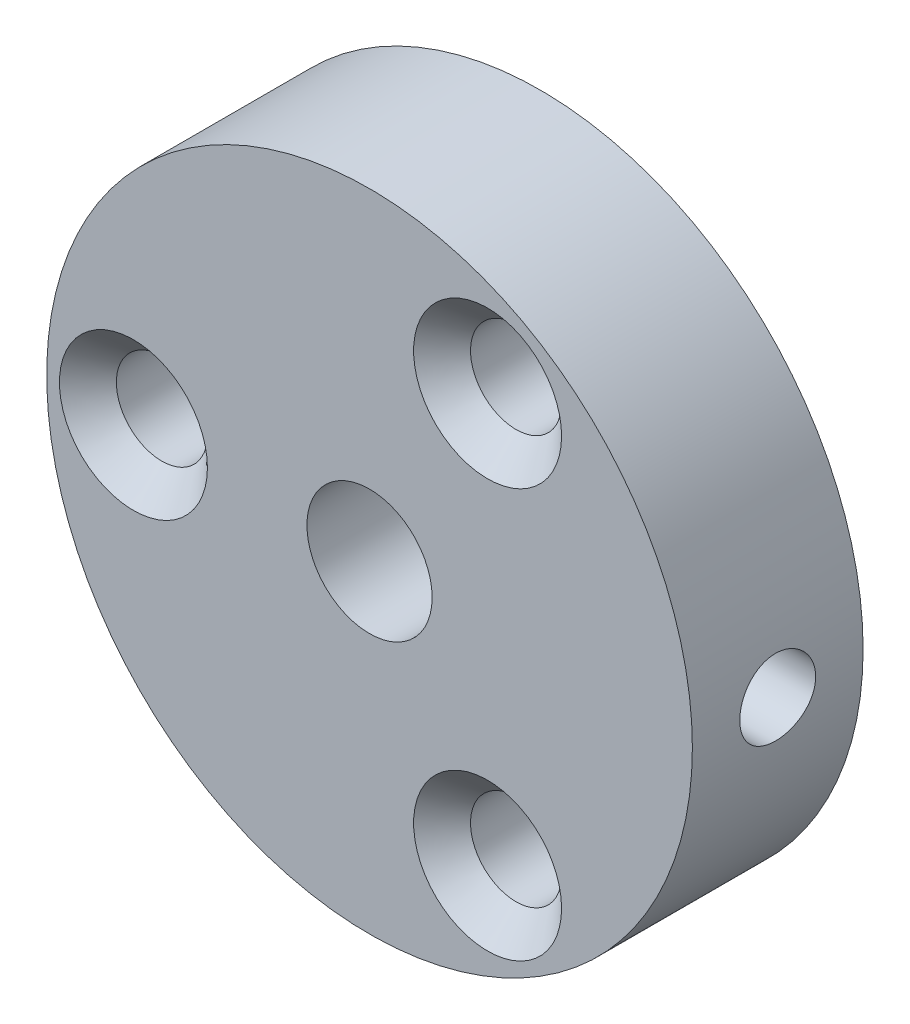
ISO-10303-21;
HEADER;
FILE_DESCRIPTION(('STEP AP214'),'2;1');
FILE_NAME('part.step','',(''),(''),'','','');
FILE_SCHEMA(('AUTOMOTIVE_DESIGN { 1 0 10303 214 1 1 1 1 }'));
ENDSEC;
DATA;
#1=APPLICATION_CONTEXT('core data for automotive mechanical design processes');
#2=APPLICATION_PROTOCOL_DEFINITION('international standard','automotive_design',2000,#1);
#3=PRODUCT_CONTEXT('',#1,'mechanical');
#4=PRODUCT('Part','Part','',(#3));
#5=PRODUCT_RELATED_PRODUCT_CATEGORY('part','',(#4));
#6=PRODUCT_DEFINITION_FORMATION('','',#4);
#7=PRODUCT_DEFINITION_CONTEXT('part definition',#1,'design');
#8=PRODUCT_DEFINITION('design','',#6,#7);
#9=PRODUCT_DEFINITION_SHAPE('','',#8);
#10=(LENGTH_UNIT() NAMED_UNIT(*) SI_UNIT(.MILLI.,.METRE.));
#11=(NAMED_UNIT(*) PLANE_ANGLE_UNIT() SI_UNIT($,.RADIAN.));
#12=(NAMED_UNIT(*) SI_UNIT($,.STERADIAN.) SOLID_ANGLE_UNIT());
#13=UNCERTAINTY_MEASURE_WITH_UNIT(LENGTH_MEASURE(1.E-05),#10,'distance_accuracy_value','');
#14=(GEOMETRIC_REPRESENTATION_CONTEXT(3) GLOBAL_UNCERTAINTY_ASSIGNED_CONTEXT((#13)) GLOBAL_UNIT_ASSIGNED_CONTEXT((#10,
#11,#12)) REPRESENTATION_CONTEXT('',''));
#15=CARTESIAN_POINT('',(0.,0.,0.));
#16=DIRECTION('',(0.,0.,1.));
#17=DIRECTION('',(1.,0.,0.));
#18=AXIS2_PLACEMENT_3D('',#15,#16,#17);
#19=CARTESIAN_POINT('',(0.,0.,2.25));
#20=DIRECTION('',(0.,0.,-1.));
#21=DIRECTION('',(-1.,0.,0.));
#22=AXIS2_PLACEMENT_3D('',#19,#20,#21);
#23=CYLINDRICAL_SURFACE('',#22,8.509);
#24=CARTESIAN_POINT('',(0.,0.,2.25));
#25=DIRECTION('',(0.,0.,1.));
#26=DIRECTION('',(1.,0.,0.));
#27=AXIS2_PLACEMENT_3D('',#24,#25,#26);
#28=CIRCLE('',#27,8.509);
#29=CARTESIAN_POINT('',(8.509,0.,2.25));
#30=VERTEX_POINT('',#29);
#31=EDGE_CURVE('E69',#30,#30,#28,.T.);
#32=ORIENTED_EDGE('',*,*,#31,.F.);
#33=EDGE_LOOP('',(#32));
#34=FACE_BOUND('',#33,.T.);
#35=CARTESIAN_POINT('',(0.,0.,-2.25));
#36=DIRECTION('',(0.,0.,1.));
#37=DIRECTION('',(1.,0.,0.));
#38=AXIS2_PLACEMENT_3D('',#35,#36,#37);
#39=CIRCLE('',#38,8.509);
#40=CARTESIAN_POINT('',(8.509,0.,-2.25));
#41=VERTEX_POINT('',#40);
#42=EDGE_CURVE('E70',#41,#41,#39,.T.);
#43=ORIENTED_EDGE('',*,*,#42,.T.);
#44=EDGE_LOOP('',(#43));
#45=FACE_BOUND('',#44,.T.);
#46=CARTESIAN_POINT('',(8.509,0.,1.));
#47=CARTESIAN_POINT('',(8.50899925825779,-0.0559634520903655,0.999997606608141));
#48=CARTESIAN_POINT('',(8.50844205250407,-0.111962530069736,0.995286305473793));
#49=CARTESIAN_POINT('',(8.50627283954904,-0.222404274914315,0.976565324354939));
#50=CARTESIAN_POINT('',(8.50465971141485,-0.276845223546583,0.962545762797024));
#51=CARTESIAN_POINT('',(8.5005604992414,-0.382555707204206,0.925625419940462));
#52=CARTESIAN_POINT('',(8.49807498355036,-0.433827281516426,0.902730419853047));
#53=CARTESIAN_POINT('',(8.49250791290803,-0.53179005335258,0.848721310130623));
#54=CARTESIAN_POINT('',(8.48942646544413,-0.578482074598571,0.817608682328109));
#55=CARTESIAN_POINT('',(8.48299508099071,-0.666198975034779,0.747884576200734));
#56=CARTESIAN_POINT('',(8.47964403116947,-0.707198237914693,0.709240970560579));
#57=CARTESIAN_POINT('',(8.47306017132751,-0.78214531751484,0.625620735354133));
#58=CARTESIAN_POINT('',(8.46982736715312,-0.816092785965369,0.580643793184871));
#59=CARTESIAN_POINT('',(8.4638349751161,-0.876066694216935,0.485468921310453));
#60=CARTESIAN_POINT('',(8.4610768172837,-0.902069374083602,0.435255921636007));
#61=CARTESIAN_POINT('',(8.45636045673469,-0.945263861567541,0.331138178339186));
#62=CARTESIAN_POINT('',(8.45440222711908,-0.962455965461184,0.277233558925333));
#63=CARTESIAN_POINT('',(8.45151792454899,-0.987463985059421,0.167527337329129));
#64=CARTESIAN_POINT('',(8.4505871147074,-0.995322943789538,0.11173567367804));
#65=CARTESIAN_POINT('',(8.44984849137229,-1.00157473295374,-0.000381874316133661));
#66=CARTESIAN_POINT('',(8.45004063777704,-0.999967901419329,-0.0567077395107053));
#67=CARTESIAN_POINT('',(8.45152188335809,-0.987369099886288,-0.167995889512193));
#68=CARTESIAN_POINT('',(8.45280545644521,-0.97642440820488,-0.222963610611169));
#69=CARTESIAN_POINT('',(8.45631630832853,-0.945534266900607,-0.330276708954445));
#70=CARTESIAN_POINT('',(8.45854360420851,-0.925588654337888,-0.382622038707648));
#71=CARTESIAN_POINT('',(8.46369724151993,-0.877211597513426,-0.483352135932232));
#72=CARTESIAN_POINT('',(8.46662528330115,-0.848759469796653,-0.531726879342225));
#73=CARTESIAN_POINT('',(8.47284914737392,-0.784191850599291,-0.623032829531791));
#74=CARTESIAN_POINT('',(8.47614498453892,-0.748076049150384,-0.66596381601854));
#75=CARTESIAN_POINT('',(8.48275767228527,-0.668943601082224,-0.745438120130147));
#76=CARTESIAN_POINT('',(8.48607452833307,-0.625886177186059,-0.781940847706062));
#77=CARTESIAN_POINT('',(8.49233665507728,-0.534233509907723,-0.8472068778295));
#78=CARTESIAN_POINT('',(8.49528192507732,-0.485638256147825,-0.875970165873205));
#79=CARTESIAN_POINT('',(8.50047056203787,-0.384259091367942,-0.924940327441846));
#80=CARTESIAN_POINT('',(8.50271373321242,-0.331474017117526,-0.945144814829844));
#81=CARTESIAN_POINT('',(8.50624359370688,-0.223228291924871,-0.976392420918683));
#82=CARTESIAN_POINT('',(8.50753032258151,-0.167767751730436,-0.987435918484318));
#83=CARTESIAN_POINT('',(8.50899719890482,-0.0560965520564369,-0.999995812028827));
#84=CARTESIAN_POINT('',(8.50918384434136,0.000107733177879293,-1.00156815357747));
#85=CARTESIAN_POINT('',(8.50844702966948,0.111979000745999,-0.995288517313536));
#86=CARTESIAN_POINT('',(8.50752359040205,0.167645993147293,-0.987436716432158));
#87=CARTESIAN_POINT('',(8.50467444269755,0.276698576186693,-0.962578137014735));
#88=CARTESIAN_POINT('',(8.50275163827508,0.330090294641814,-0.945597879606065));
#89=CARTESIAN_POINT('',(8.49811916421571,0.433268047041117,-0.902991864549742));
#90=CARTESIAN_POINT('',(8.49540947071746,0.483053971587247,-0.877365844727173));
#91=CARTESIAN_POINT('',(8.48948942178983,0.577857753132633,-0.81805928715919));
#92=CARTESIAN_POINT('',(8.48627682893315,0.622852714490904,-0.78434237696329));
#93=CARTESIAN_POINT('',(8.47971778274679,0.706564766332041,-0.709862817010008));
#94=CARTESIAN_POINT('',(8.47637132474337,0.745281637383764,-0.669099921084915));
#95=CARTESIAN_POINT('',(8.46990182241028,0.81553561305717,-0.581439797438692));
#96=CARTESIAN_POINT('',(8.46677998227011,0.847035749023108,-0.534512840023763));
#97=CARTESIAN_POINT('',(8.46113254328747,0.901707093846463,-0.43600169851697));
#98=CARTESIAN_POINT('',(8.45860693368037,0.924878453079572,-0.384417598530649));
#99=CARTESIAN_POINT('',(8.45444592773114,0.962173983214904,-0.278178146148385));
#100=CARTESIAN_POINT('',(8.45280844544353,0.976319367357207,-0.223530325847549));
#101=CARTESIAN_POINT('',(8.45060297021628,0.995229901415122,-0.112614703606158));
#102=CARTESIAN_POINT('',(8.45003493373592,0.999995433216293,-0.0563469677124958));
#103=CARTESIAN_POINT('',(8.45003382766369,1.00000453253293,0.0558435937758986));
#104=CARTESIAN_POINT('',(8.45059383593724,0.995306174273132,0.111766423535659));
#105=CARTESIAN_POINT('',(8.45277087882812,0.976643451037344,0.222021945402417));
#106=CARTESIAN_POINT('',(8.45438791394645,0.962679081669425,0.276354636755705));
#107=CARTESIAN_POINT('',(8.45849474268797,0.925898225279686,0.381882217127995));
#108=CARTESIAN_POINT('',(8.46098429441736,0.903084191524197,0.433077971204865));
#109=CARTESIAN_POINT('',(8.46655607777641,0.849257371181599,0.530923609507969));
#110=CARTESIAN_POINT('',(8.46963831340704,0.818244529247117,0.577573463043461));
#111=CARTESIAN_POINT('',(8.47607085048014,0.748683974172605,0.665300293273617));
#112=CARTESIAN_POINT('',(8.47942262416174,0.710092948476129,0.706342820454559));
#113=CARTESIAN_POINT('',(8.48600341074547,0.626560878199812,0.781392555080238));
#114=CARTESIAN_POINT('',(8.48923239437871,0.581618331529961,0.8153980936253));
#115=CARTESIAN_POINT('',(8.49521564998804,0.486486832924008,0.875504446750713));
#116=CARTESIAN_POINT('',(8.49796828151283,0.436280671168707,0.901578170652469));
#117=CARTESIAN_POINT('',(8.50267177238277,0.332199506306004,0.944888246073913));
#118=CARTESIAN_POINT('',(8.50462351307138,0.278328612615535,0.962134317219011));
#119=CARTESIAN_POINT('',(8.50702836747934,0.186808530738704,0.98311555113376));
#120=CARTESIAN_POINT('',(8.5077641777693,0.149739192003193,0.98943826597467));
#121=CARTESIAN_POINT('',(8.50875024147301,0.0751185847622236,0.99788128060772));
#122=CARTESIAN_POINT('',(8.50900049791901,0.0375673192678381,1.00000160664349));
#123=CARTESIAN_POINT('',(8.509,0.,1.));
#124=B_SPLINE_CURVE_WITH_KNOTS('',3,(#46,#47,#48,#49,#50,#51,#52,#53,#54,#55,#56,#57,#58,#59,
#60,#61,#62,#63,#64,#65,#66,#67,#68,#69,#70,#71,#72,#73,#74,#75,#76,#77,#78,#79,#80,#81,#82,#83,
#84,#85,#86,#87,#88,#89,#90,#91,#92,#93,#94,#95,#96,#97,#98,#99,#100,#101,#102,#103,#104,#105,
#106,#107,#108,#109,#110,#111,#112,#113,#114,#115,#116,#117,#118,#119,#120,#121,#122,#123),
.UNSPECIFIED.,.T.,.F.,(4,2,2,2,2,2,2,2,2,2,2,2,2,2,2,2,2,2,2,2,2,2,2,2,2,2,2,2,2,2,2,2,2,2,2,2,
2,2,4),(0.,0.167753147833018,0.335684666392649,0.503506982382304,0.671299056678312,
0.839823256160012,1.00835577663386,1.17738749066775,1.34641352023906,1.5146569626014,
1.68289439688221,1.85028505256265,2.01767873856674,2.18548279635464,2.35329364251334,
2.52212880997337,2.69096429383063,2.85984681697317,3.02872235540837,3.19659936984032,
3.36447323255681,3.53186198245332,3.69925580871837,3.86741673326328,4.03558353408464,
4.20459343340983,4.37360028111557,4.542208444151,4.71080974243499,4.87837958749061,
5.04594951197146,5.21347301658984,5.38099765213148,5.54950919624088,5.7180606590405,
5.88718149878873,6.05611572649447,6.16872628184058,6.28133613393927),.UNSPECIFIED.);
#125=CARTESIAN_POINT('',(8.509,0.,1.));
#126=VERTEX_POINT('',#125);
#127=EDGE_CURVE('E10',#126,#126,#124,.T.);
#128=ORIENTED_EDGE('',*,*,#127,.F.);
#129=EDGE_LOOP('',(#128));
#130=FACE_BOUND('',#129,.T.);
#131=ADVANCED_FACE('F34',(#34,#45,#130),#23,.T.);
#132=CARTESIAN_POINT('',(0.,0.,2.25));
#133=DIRECTION('',(0.,0.,1.));
#134=DIRECTION('',(1.,0.,0.));
#135=AXIS2_PLACEMENT_3D('',#132,#133,#134);
#136=PLANE('',#135);
#137=CARTESIAN_POINT('',(0.,0.,2.25));
#138=DIRECTION('',(0.,0.,1.));
#139=DIRECTION('',(1.,0.,0.));
#140=AXIS2_PLACEMENT_3D('',#137,#138,#139);
#141=CIRCLE('',#140,1.65);
#142=CARTESIAN_POINT('',(1.65,0.,2.25));
#143=VERTEX_POINT('',#142);
#144=EDGE_CURVE('E87',#143,#143,#141,.T.);
#145=ORIENTED_EDGE('',*,*,#144,.F.);
#146=EDGE_LOOP('',(#145));
#147=FACE_BOUND('',#146,.T.);
#148=CARTESIAN_POINT('',(-6.223,0.,2.25));
#149=DIRECTION('',(0.,0.,1.));
#150=DIRECTION('',(1.,0.,0.));
#151=AXIS2_PLACEMENT_3D('',#148,#149,#150);
#152=CIRCLE('',#151,1.94999999999999);
#153=CARTESIAN_POINT('',(-4.27300000000001,0.,2.25));
#154=VERTEX_POINT('',#153);
#155=EDGE_CURVE('E47',#154,#154,#152,.F.);
#156=ORIENTED_EDGE('',*,*,#155,.T.);
#157=EDGE_LOOP('',(#156));
#158=FACE_BOUND('',#157,.T.);
#159=CARTESIAN_POINT('',(3.11150000000001,5.38927608775055,2.25));
#160=DIRECTION('',(0.,0.,1.));
#161=DIRECTION('',(1.,0.,0.));
#162=AXIS2_PLACEMENT_3D('',#159,#160,#161);
#163=CIRCLE('',#162,1.94999999999998);
#164=CARTESIAN_POINT('',(5.06149999999999,5.38927608775055,2.25));
#165=VERTEX_POINT('',#164);
#166=EDGE_CURVE('E55',#165,#165,#163,.F.);
#167=ORIENTED_EDGE('',*,*,#166,.T.);
#168=EDGE_LOOP('',(#167));
#169=FACE_BOUND('',#168,.T.);
#170=CARTESIAN_POINT('',(3.11149999999999,-5.38927608775058,2.25));
#171=DIRECTION('',(0.,0.,1.));
#172=DIRECTION('',(1.,0.,0.));
#173=AXIS2_PLACEMENT_3D('',#170,#171,#172);
#174=CIRCLE('',#173,1.94999999999998);
#175=CARTESIAN_POINT('',(5.06149999999998,-5.38927608775058,2.25));
#176=VERTEX_POINT('',#175);
#177=EDGE_CURVE('E63',#176,#176,#174,.F.);
#178=ORIENTED_EDGE('',*,*,#177,.T.);
#179=EDGE_LOOP('',(#178));
#180=FACE_BOUND('',#179,.T.);
#181=ORIENTED_EDGE('',*,*,#31,.T.);
#182=EDGE_LOOP('',(#181));
#183=FACE_BOUND('',#182,.T.);
#184=ADVANCED_FACE('F108',(#147,#158,#169,#180,#183),#136,.T.);
#185=CARTESIAN_POINT('',(0.,0.,-2.25));
#186=DIRECTION('',(0.,0.,1.));
#187=DIRECTION('',(1.,0.,0.));
#188=AXIS2_PLACEMENT_3D('',#185,#186,#187);
#189=PLANE('',#188);
#190=CARTESIAN_POINT('',(0.,0.,-2.25));
#191=DIRECTION('',(0.,0.,1.));
#192=DIRECTION('',(1.,0.,0.));
#193=AXIS2_PLACEMENT_3D('',#190,#191,#192);
#194=CIRCLE('',#193,1.65);
#195=CARTESIAN_POINT('',(1.65,0.,-2.25));
#196=VERTEX_POINT('',#195);
#197=EDGE_CURVE('E84',#196,#196,#194,.T.);
#198=ORIENTED_EDGE('',*,*,#197,.T.);
#199=EDGE_LOOP('',(#198));
#200=FACE_BOUND('',#199,.T.);
#201=CARTESIAN_POINT('',(-6.223,0.,-2.25));
#202=DIRECTION('',(0.,0.,1.));
#203=DIRECTION('',(1.,0.,0.));
#204=AXIS2_PLACEMENT_3D('',#201,#202,#203);
#205=CIRCLE('',#204,1.2);
#206=CARTESIAN_POINT('',(-5.023,0.,-2.25));
#207=VERTEX_POINT('',#206);
#208=EDGE_CURVE('E81',#207,#207,#205,.T.);
#209=ORIENTED_EDGE('',*,*,#208,.T.);
#210=EDGE_LOOP('',(#209));
#211=FACE_BOUND('',#210,.T.);
#212=CARTESIAN_POINT('',(3.11150000000001,5.38927608775055,-2.25));
#213=DIRECTION('',(0.,0.,1.));
#214=DIRECTION('',(1.,0.,0.));
#215=AXIS2_PLACEMENT_3D('',#212,#213,#214);
#216=CIRCLE('',#215,1.2);
#217=CARTESIAN_POINT('',(4.31150000000001,5.38927608775055,-2.25));
#218=VERTEX_POINT('',#217);
#219=EDGE_CURVE('E78',#218,#218,#216,.T.);
#220=ORIENTED_EDGE('',*,*,#219,.T.);
#221=EDGE_LOOP('',(#220));
#222=FACE_BOUND('',#221,.T.);
#223=CARTESIAN_POINT('',(3.11149999999999,-5.38927608775058,-2.25));
#224=DIRECTION('',(0.,0.,1.));
#225=DIRECTION('',(1.,0.,0.));
#226=AXIS2_PLACEMENT_3D('',#223,#224,#225);
#227=CIRCLE('',#226,1.2);
#228=CARTESIAN_POINT('',(4.31149999999999,-5.38927608775058,-2.25));
#229=VERTEX_POINT('',#228);
#230=EDGE_CURVE('E73',#229,#229,#227,.T.);
#231=ORIENTED_EDGE('',*,*,#230,.T.);
#232=EDGE_LOOP('',(#231));
#233=FACE_BOUND('',#232,.T.);
#234=ORIENTED_EDGE('',*,*,#42,.F.);
#235=EDGE_LOOP('',(#234));
#236=FACE_BOUND('',#235,.T.);
#237=ADVANCED_FACE('F113',(#200,#211,#222,#233,#236),#189,.F.);
#238=CARTESIAN_POINT('',(3.11149999999999,-5.38927608775058,2.25));
#239=DIRECTION('',(0.,0.,1.));
#240=DIRECTION('',(1.,0.,0.));
#241=AXIS2_PLACEMENT_3D('',#238,#239,#240);
#242=CYLINDRICAL_SURFACE('',#241,1.19999999999999);
#243=CARTESIAN_POINT('',(3.11149999999999,-5.38927608775058,1.50000000000001));
#244=DIRECTION('',(0.,0.,1.));
#245=DIRECTION('',(1.,0.,0.));
#246=AXIS2_PLACEMENT_3D('',#243,#244,#245);
#247=CIRCLE('',#246,1.19999999999999);
#248=CARTESIAN_POINT('',(4.31149999999999,-5.38927608775058,1.50000000000001));
#249=VERTEX_POINT('',#248);
#250=EDGE_CURVE('E66',#249,#249,#247,.T.);
#251=ORIENTED_EDGE('',*,*,#250,.T.);
#252=EDGE_LOOP('',(#251));
#253=FACE_BOUND('',#252,.T.);
#254=ORIENTED_EDGE('',*,*,#230,.F.);
#255=EDGE_LOOP('',(#254));
#256=FACE_BOUND('',#255,.T.);
#257=ADVANCED_FACE('F145',(#253,#256),#242,.F.);
#258=CARTESIAN_POINT('',(3.11150000000001,5.38927608775055,2.25));
#259=DIRECTION('',(0.,0.,1.));
#260=DIRECTION('',(1.,0.,0.));
#261=AXIS2_PLACEMENT_3D('',#258,#259,#260);
#262=CYLINDRICAL_SURFACE('',#261,1.19999999999999);
#263=CARTESIAN_POINT('',(3.11150000000001,5.38927608775055,1.50000000000001));
#264=DIRECTION('',(0.,0.,1.));
#265=DIRECTION('',(1.,0.,0.));
#266=AXIS2_PLACEMENT_3D('',#263,#264,#265);
#267=CIRCLE('',#266,1.19999999999999);
#268=CARTESIAN_POINT('',(4.3115,5.38927608775055,1.50000000000001));
#269=VERTEX_POINT('',#268);
#270=EDGE_CURVE('E60',#269,#269,#267,.T.);
#271=ORIENTED_EDGE('',*,*,#270,.T.);
#272=EDGE_LOOP('',(#271));
#273=FACE_BOUND('',#272,.T.);
#274=ORIENTED_EDGE('',*,*,#219,.F.);
#275=EDGE_LOOP('',(#274));
#276=FACE_BOUND('',#275,.T.);
#277=ADVANCED_FACE('F142',(#273,#276),#262,.F.);
#278=CARTESIAN_POINT('',(-6.223,0.,2.25));
#279=DIRECTION('',(0.,0.,1.));
#280=DIRECTION('',(1.,0.,0.));
#281=AXIS2_PLACEMENT_3D('',#278,#279,#280);
#282=CYLINDRICAL_SURFACE('',#281,1.19999999999999);
#283=CARTESIAN_POINT('',(-6.223,0.,1.50000000000001));
#284=DIRECTION('',(0.,0.,1.));
#285=DIRECTION('',(1.,0.,0.));
#286=AXIS2_PLACEMENT_3D('',#283,#284,#285);
#287=CIRCLE('',#286,1.19999999999999);
#288=CARTESIAN_POINT('',(-5.02300000000001,0.,1.50000000000001));
#289=VERTEX_POINT('',#288);
#290=EDGE_CURVE('E51',#289,#289,#287,.T.);
#291=ORIENTED_EDGE('',*,*,#290,.T.);
#292=EDGE_LOOP('',(#291));
#293=FACE_BOUND('',#292,.T.);
#294=ORIENTED_EDGE('',*,*,#208,.F.);
#295=EDGE_LOOP('',(#294));
#296=FACE_BOUND('',#295,.T.);
#297=ADVANCED_FACE('F128',(#293,#296),#282,.F.);
#298=CARTESIAN_POINT('',(3.11149999999999,-5.38927608775058,1.50000000000001));
#299=DIRECTION('',(0.,0.,1.));
#300=DIRECTION('',(1.,0.,0.));
#301=AXIS2_PLACEMENT_3D('',#298,#299,#300);
#302=CONICAL_SURFACE('',#301,1.19999999999999,0.78539816339745);
#303=ORIENTED_EDGE('',*,*,#177,.F.);
#304=EDGE_LOOP('',(#303));
#305=FACE_BOUND('',#304,.T.);
#306=ORIENTED_EDGE('',*,*,#250,.F.);
#307=EDGE_LOOP('',(#306));
#308=FACE_BOUND('',#307,.T.);
#309=ADVANCED_FACE('F122',(#305,#308),#302,.F.);
#310=CARTESIAN_POINT('',(3.11150000000001,5.38927608775055,1.50000000000001));
#311=DIRECTION('',(0.,0.,1.));
#312=DIRECTION('',(1.,0.,0.));
#313=AXIS2_PLACEMENT_3D('',#310,#311,#312);
#314=CONICAL_SURFACE('',#313,1.19999999999999,0.78539816339745);
#315=ORIENTED_EDGE('',*,*,#166,.F.);
#316=EDGE_LOOP('',(#315));
#317=FACE_BOUND('',#316,.T.);
#318=ORIENTED_EDGE('',*,*,#270,.F.);
#319=EDGE_LOOP('',(#318));
#320=FACE_BOUND('',#319,.T.);
#321=ADVANCED_FACE('F127',(#317,#320),#314,.F.);
#322=CARTESIAN_POINT('',(-6.223,0.,1.50000000000001));
#323=DIRECTION('',(0.,0.,1.));
#324=DIRECTION('',(1.,0.,0.));
#325=AXIS2_PLACEMENT_3D('',#322,#323,#324);
#326=CONICAL_SURFACE('',#325,1.19999999999999,0.78539816339745);
#327=ORIENTED_EDGE('',*,*,#155,.F.);
#328=EDGE_LOOP('',(#327));
#329=FACE_BOUND('',#328,.T.);
#330=ORIENTED_EDGE('',*,*,#290,.F.);
#331=EDGE_LOOP('',(#330));
#332=FACE_BOUND('',#331,.T.);
#333=ADVANCED_FACE('F37',(#329,#332),#326,.F.);
#334=CARTESIAN_POINT('',(0.,0.,2.25));
#335=DIRECTION('',(0.,0.,1.));
#336=DIRECTION('',(1.,0.,0.));
#337=AXIS2_PLACEMENT_3D('',#334,#335,#336);
#338=CYLINDRICAL_SURFACE('',#337,1.65);
#339=ORIENTED_EDGE('',*,*,#197,.F.);
#340=EDGE_LOOP('',(#339));
#341=FACE_BOUND('',#340,.T.);
#342=ORIENTED_EDGE('',*,*,#144,.T.);
#343=EDGE_LOOP('',(#342));
#344=FACE_BOUND('',#343,.T.);
#345=ADVANCED_FACE('F98',(#341,#344),#338,.F.);
#346=CARTESIAN_POINT('',(8.509,0.,0.));
#347=DIRECTION('',(-1.,0.,0.));
#348=DIRECTION('',(0.,0.,1.));
#349=AXIS2_PLACEMENT_3D('',#346,#347,#348);
#350=CYLINDRICAL_SURFACE('',#349,1.);
#351=CARTESIAN_POINT('',(5.,0.,0.));
#352=DIRECTION('',(1.,0.,0.));
#353=DIRECTION('',(0.,0.,-1.));
#354=AXIS2_PLACEMENT_3D('',#351,#352,#353);
#355=CIRCLE('',#354,1.);
#356=CARTESIAN_POINT('',(5.,0.,-1.));
#357=VERTEX_POINT('',#356);
#358=EDGE_CURVE('E90',#357,#357,#355,.T.);
#359=ORIENTED_EDGE('',*,*,#358,.F.);
#360=EDGE_LOOP('',(#359));
#361=FACE_BOUND('',#360,.T.);
#362=ORIENTED_EDGE('',*,*,#127,.T.);
#363=EDGE_LOOP('',(#362));
#364=FACE_BOUND('',#363,.T.);
#365=ADVANCED_FACE('F96',(#361,#364),#350,.F.);
#366=CARTESIAN_POINT('',(5.,0.,0.));
#367=DIRECTION('',(1.,0.,0.));
#368=DIRECTION('',(0.,0.,-1.));
#369=AXIS2_PLACEMENT_3D('',#366,#367,#368);
#370=PLANE('',#369);
#371=ORIENTED_EDGE('',*,*,#358,.T.);
#372=EDGE_LOOP('',(#371));
#373=FACE_BOUND('',#372,.T.);
#374=ADVANCED_FACE('F94',(#373),#370,.T.);
#375=CLOSED_SHELL('',(#131,#184,#237,#257,#277,#297,#309,#321,#333,#345,#365,#374));
#376=MANIFOLD_SOLID_BREP('B2',#375);
#377=ADVANCED_BREP_SHAPE_REPRESENTATION('',(#18,#376),#14);
#378=SHAPE_DEFINITION_REPRESENTATION(#9,#377);
ENDSEC;
END-ISO-10303-21;
